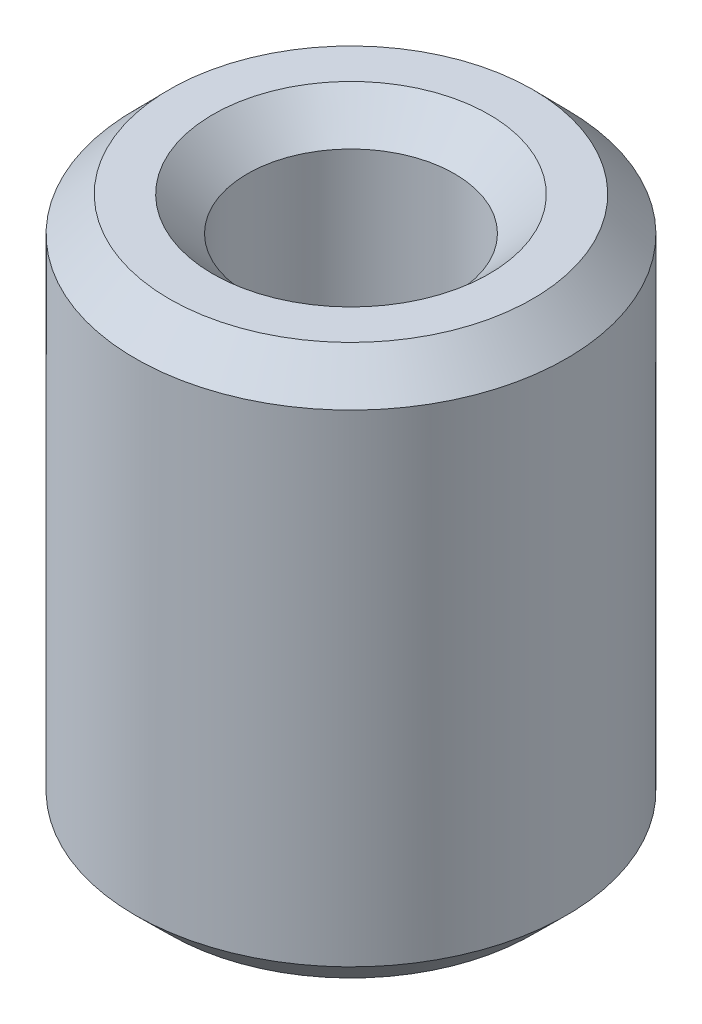
ISO-10303-21;
HEADER;
FILE_DESCRIPTION(('STEP AP214'),'2;1');
FILE_NAME('part.step','',(''),(''),'','','');
FILE_SCHEMA(('AUTOMOTIVE_DESIGN { 1 0 10303 214 1 1 1 1 }'));
ENDSEC;
DATA;
#1=APPLICATION_CONTEXT('core data for automotive mechanical design processes');
#2=APPLICATION_PROTOCOL_DEFINITION('international standard','automotive_design',2000,#1);
#3=PRODUCT_CONTEXT('',#1,'mechanical');
#4=PRODUCT('Part','Part','',(#3));
#5=PRODUCT_RELATED_PRODUCT_CATEGORY('part','',(#4));
#6=PRODUCT_DEFINITION_FORMATION('','',#4);
#7=PRODUCT_DEFINITION_CONTEXT('part definition',#1,'design');
#8=PRODUCT_DEFINITION('design','',#6,#7);
#9=PRODUCT_DEFINITION_SHAPE('','',#8);
#10=(LENGTH_UNIT() NAMED_UNIT(*) SI_UNIT(.MILLI.,.METRE.));
#11=(NAMED_UNIT(*) PLANE_ANGLE_UNIT() SI_UNIT($,.RADIAN.));
#12=(NAMED_UNIT(*) SI_UNIT($,.STERADIAN.) SOLID_ANGLE_UNIT());
#13=UNCERTAINTY_MEASURE_WITH_UNIT(LENGTH_MEASURE(1.E-05),#10,'distance_accuracy_value','');
#14=(GEOMETRIC_REPRESENTATION_CONTEXT(3) GLOBAL_UNCERTAINTY_ASSIGNED_CONTEXT((#13)) GLOBAL_UNIT_ASSIGNED_CONTEXT((#10,
#11,#12)) REPRESENTATION_CONTEXT('',''));
#15=CARTESIAN_POINT('',(0.,0.,0.));
#16=DIRECTION('',(0.,0.,1.));
#17=DIRECTION('',(1.,0.,0.));
#18=AXIS2_PLACEMENT_3D('',#15,#16,#17);
#19=CARTESIAN_POINT('',(0.,19.1574992994997,0.));
#20=DIRECTION('',(0.,-1.,0.));
#21=DIRECTION('',(0.,0.,-1.));
#22=AXIS2_PLACEMENT_3D('',#19,#20,#21);
#23=CYLINDRICAL_SURFACE('',#22,7.5);
#24=CARTESIAN_POINT('',(0.,1.18473737385999,0.));
#25=DIRECTION('',(0.,1.,0.));
#26=DIRECTION('',(0.,0.,1.));
#27=AXIS2_PLACEMENT_3D('',#24,#25,#26);
#28=CIRCLE('',#27,7.5);
#29=CARTESIAN_POINT('',(0.,1.18473737385999,7.5));
#30=VERTEX_POINT('',#29);
#31=EDGE_CURVE('E10',#30,#30,#28,.T.);
#32=ORIENTED_EDGE('',*,*,#31,.T.);
#33=EDGE_LOOP('',(#32));
#34=FACE_BOUND('',#33,.T.);
#35=CARTESIAN_POINT('',(0.,17.9564030926638,0.));
#36=DIRECTION('',(0.,1.,0.));
#37=DIRECTION('',(0.,0.,1.));
#38=AXIS2_PLACEMENT_3D('',#35,#36,#37);
#39=CIRCLE('',#38,7.5);
#40=CARTESIAN_POINT('',(0.,17.9564030926638,-7.5));
#41=VERTEX_POINT('',#40);
#42=EDGE_CURVE('E50',#41,#41,#39,.F.);
#43=ORIENTED_EDGE('',*,*,#42,.T.);
#44=EDGE_LOOP('',(#43));
#45=FACE_BOUND('',#44,.T.);
#46=ADVANCED_FACE('F39',(#34,#45),#23,.T.);
#47=CARTESIAN_POINT('',(0.,19.1574992994997,0.));
#48=DIRECTION('',(0.,1.,0.));
#49=DIRECTION('',(0.,0.,1.));
#50=AXIS2_PLACEMENT_3D('',#47,#48,#49);
#51=PLANE('',#50);
#52=CARTESIAN_POINT('',(0.,19.1574992994997,0.));
#53=DIRECTION('',(0.,1.,0.));
#54=DIRECTION('',(0.,0.,1.));
#55=AXIS2_PLACEMENT_3D('',#52,#53,#54);
#56=CIRCLE('',#55,4.80481325600281);
#57=CARTESIAN_POINT('',(0.,19.1574992994997,4.80481325600281));
#58=VERTEX_POINT('',#57);
#59=EDGE_CURVE('E58',#58,#58,#56,.F.);
#60=ORIENTED_EDGE('',*,*,#59,.T.);
#61=EDGE_LOOP('',(#60));
#62=FACE_BOUND('',#61,.T.);
#63=CARTESIAN_POINT('',(0.,19.1574992994997,0.));
#64=DIRECTION('',(0.,1.,0.));
#65=DIRECTION('',(0.,0.,1.));
#66=AXIS2_PLACEMENT_3D('',#63,#64,#65);
#67=CIRCLE('',#66,6.31526262614001);
#68=CARTESIAN_POINT('',(0.,19.1574992994997,-6.31526262614001));
#69=VERTEX_POINT('',#68);
#70=EDGE_CURVE('E61',#69,#69,#67,.T.);
#71=ORIENTED_EDGE('',*,*,#70,.T.);
#72=EDGE_LOOP('',(#71));
#73=FACE_BOUND('',#72,.T.);
#74=ADVANCED_FACE('F88',(#62,#73),#51,.T.);
#75=CARTESIAN_POINT('',(0.,0.,0.));
#76=DIRECTION('',(0.,1.,0.));
#77=DIRECTION('',(0.,0.,1.));
#78=AXIS2_PLACEMENT_3D('',#75,#76,#77);
#79=PLANE('',#78);
#80=CARTESIAN_POINT('',(0.,0.,0.));
#81=DIRECTION('',(0.,1.,0.));
#82=DIRECTION('',(0.,0.,1.));
#83=AXIS2_PLACEMENT_3D('',#80,#81,#82);
#84=CIRCLE('',#83,4.78845442302691);
#85=CARTESIAN_POINT('',(0.,0.,4.78845442302691));
#86=VERTEX_POINT('',#85);
#87=EDGE_CURVE('E51',#86,#86,#84,.T.);
#88=ORIENTED_EDGE('',*,*,#87,.T.);
#89=EDGE_LOOP('',(#88));
#90=FACE_BOUND('',#89,.T.);
#91=CARTESIAN_POINT('',(0.,0.,0.));
#92=DIRECTION('',(0.,1.,0.));
#93=DIRECTION('',(0.,0.,1.));
#94=AXIS2_PLACEMENT_3D('',#91,#92,#93);
#95=CIRCLE('',#94,6.29890379316409);
#96=CARTESIAN_POINT('',(0.,0.,6.29890379316409));
#97=VERTEX_POINT('',#96);
#98=EDGE_CURVE('E54',#97,#97,#95,.F.);
#99=ORIENTED_EDGE('',*,*,#98,.T.);
#100=EDGE_LOOP('',(#99));
#101=FACE_BOUND('',#100,.T.);
#102=ADVANCED_FACE('F83',(#90,#101),#79,.F.);
#103=CARTESIAN_POINT('',(0.,19.1574992994997,0.));
#104=DIRECTION('',(0.,-1.,0.));
#105=DIRECTION('',(0.,0.,-1.));
#106=AXIS2_PLACEMENT_3D('',#103,#104,#105);
#107=CYLINDRICAL_SURFACE('',#106,3.60371704916692);
#108=CARTESIAN_POINT('',(0.,17.9727619256397,0.));
#109=DIRECTION('',(0.,1.,0.));
#110=DIRECTION('',(0.,0.,1.));
#111=AXIS2_PLACEMENT_3D('',#108,#109,#110);
#112=CIRCLE('',#111,3.60371704916692);
#113=CARTESIAN_POINT('',(0.,17.9727619256397,3.60371704916692));
#114=VERTEX_POINT('',#113);
#115=EDGE_CURVE('E67',#114,#114,#112,.T.);
#116=ORIENTED_EDGE('',*,*,#115,.T.);
#117=EDGE_LOOP('',(#116));
#118=FACE_BOUND('',#117,.T.);
#119=CARTESIAN_POINT('',(0.,1.20109620683591,0.));
#120=DIRECTION('',(0.,1.,0.));
#121=DIRECTION('',(0.,0.,1.));
#122=AXIS2_PLACEMENT_3D('',#119,#120,#121);
#123=CIRCLE('',#122,3.60371704916692);
#124=CARTESIAN_POINT('',(0.,1.20109620683591,3.60371704916692));
#125=VERTEX_POINT('',#124);
#126=EDGE_CURVE('E69',#125,#125,#123,.F.);
#127=ORIENTED_EDGE('',*,*,#126,.T.);
#128=EDGE_LOOP('',(#127));
#129=FACE_BOUND('',#128,.T.);
#130=ADVANCED_FACE('F71',(#118,#129),#107,.F.);
#131=CARTESIAN_POINT('',(0.,17.9727619256397,0.));
#132=DIRECTION('',(0.,1.,0.));
#133=DIRECTION('',(0.,0.,1.));
#134=AXIS2_PLACEMENT_3D('',#131,#132,#133);
#135=CONICAL_SURFACE('',#134,3.60371704916692,0.792254708947175);
#136=ORIENTED_EDGE('',*,*,#59,.F.);
#137=EDGE_LOOP('',(#136));
#138=FACE_BOUND('',#137,.T.);
#139=ORIENTED_EDGE('',*,*,#115,.F.);
#140=EDGE_LOOP('',(#139));
#141=FACE_BOUND('',#140,.T.);
#142=ADVANCED_FACE('F77',(#138,#141),#135,.F.);
#143=CARTESIAN_POINT('',(0.,0.,0.));
#144=DIRECTION('',(0.,-1.,0.));
#145=DIRECTION('',(0.,0.,-1.));
#146=AXIS2_PLACEMENT_3D('',#143,#144,#145);
#147=CONICAL_SURFACE('',#146,4.78845442302691,0.77854161784772);
#148=ORIENTED_EDGE('',*,*,#126,.F.);
#149=EDGE_LOOP('',(#148));
#150=FACE_BOUND('',#149,.T.);
#151=ORIENTED_EDGE('',*,*,#87,.F.);
#152=EDGE_LOOP('',(#151));
#153=FACE_BOUND('',#152,.T.);
#154=ADVANCED_FACE('F73',(#150,#153),#147,.F.);
#155=CARTESIAN_POINT('',(0.,1.18473737385999,0.));
#156=DIRECTION('',(0.,1.,0.));
#157=DIRECTION('',(0.,0.,1.));
#158=AXIS2_PLACEMENT_3D('',#155,#156,#157);
#159=CONICAL_SURFACE('',#158,7.5,0.792254708947176);
#160=ORIENTED_EDGE('',*,*,#98,.F.);
#161=EDGE_LOOP('',(#160));
#162=FACE_BOUND('',#161,.T.);
#163=ORIENTED_EDGE('',*,*,#31,.F.);
#164=EDGE_LOOP('',(#163));
#165=FACE_BOUND('',#164,.T.);
#166=ADVANCED_FACE('F76',(#162,#165),#159,.T.);
#167=CARTESIAN_POINT('',(0.,19.1574992994997,0.));
#168=DIRECTION('',(0.,-1.,0.));
#169=DIRECTION('',(0.,0.,-1.));
#170=AXIS2_PLACEMENT_3D('',#167,#168,#169);
#171=CONICAL_SURFACE('',#170,6.31526262614001,0.778541617847721);
#172=CARTESIAN_POINT('',(0.,17.9564030926638,-7.5));
#173=CARTESIAN_POINT('',(0.,17.968914511485,-7.48765898568896));
#174=CARTESIAN_POINT('',(0.,17.9814259303062,-7.47531797137792));
#175=CARTESIAN_POINT('',(0.,18.0064487679486,-7.45063594275584));
#176=CARTESIAN_POINT('',(0.,18.0189601867698,-7.43829492844479));
#177=CARTESIAN_POINT('',(0.,18.0439830244122,-7.41361289982271));
#178=CARTESIAN_POINT('',(0.,18.0564944432334,-7.40127188551167));
#179=CARTESIAN_POINT('',(0.,18.0815172808759,-7.37658985688959));
#180=CARTESIAN_POINT('',(0.,18.0940286996971,-7.36424884257854));
#181=CARTESIAN_POINT('',(0.,18.1190515373395,-7.33956681395646));
#182=CARTESIAN_POINT('',(0.,18.1315629561607,-7.32722579964542));
#183=CARTESIAN_POINT('',(0.,18.1565857938031,-7.30254377102334));
#184=CARTESIAN_POINT('',(0.,18.1690972126243,-7.29020275671229));
#185=CARTESIAN_POINT('',(0.,18.1941200502667,-7.26552072809021));
#186=CARTESIAN_POINT('',(0.,18.2066314690879,-7.25317971377917));
#187=CARTESIAN_POINT('',(0.,18.2316543067303,-7.22849768515709));
#188=CARTESIAN_POINT('',(0.,18.2441657255516,-7.21615667084605));
#189=CARTESIAN_POINT('',(0.,18.269188563194,-7.19147464222396));
#190=CARTESIAN_POINT('',(0.,18.2816999820152,-7.17913362791292));
#191=CARTESIAN_POINT('',(0.,18.3067228196576,-7.15445159929084));
#192=CARTESIAN_POINT('',(0.,18.3192342384788,-7.1421105849798));
#193=CARTESIAN_POINT('',(0.,18.3442570761212,-7.11742855635771));
#194=CARTESIAN_POINT('',(0.,18.3567684949424,-7.10508754204667));
#195=CARTESIAN_POINT('',(0.,18.3817913325848,-7.08040551342459));
#196=CARTESIAN_POINT('',(0.,18.394302751406,-7.06806449911355));
#197=CARTESIAN_POINT('',(0.,18.4193255890485,-7.04338247049146));
#198=CARTESIAN_POINT('',(0.,18.4318370078697,-7.03104145618042));
#199=CARTESIAN_POINT('',(0.,18.4568598455121,-7.00635942755834));
#200=CARTESIAN_POINT('',(0.,18.4693712643333,-6.9940184132473));
#201=CARTESIAN_POINT('',(0.,18.4943941019757,-6.96933638462521));
#202=CARTESIAN_POINT('',(0.,18.5069055207969,-6.95699537031417));
#203=CARTESIAN_POINT('',(0.,18.5319283584393,-6.93231334169209));
#204=CARTESIAN_POINT('',(0.,18.5444397772605,-6.91997232738105));
#205=CARTESIAN_POINT('',(0.,18.5694626149029,-6.89529029875897));
#206=CARTESIAN_POINT('',(0.,18.5819740337242,-6.88294928444792));
#207=CARTESIAN_POINT('',(0.,18.6069968713666,-6.85826725582584));
#208=CARTESIAN_POINT('',(0.,18.6195082901878,-6.8459262415148));
#209=CARTESIAN_POINT('',(0.,18.6445311278302,-6.82124421289272));
#210=CARTESIAN_POINT('',(0.,18.6570425466514,-6.80890319858167));
#211=CARTESIAN_POINT('',(0.,18.6820653842938,-6.78422116995959));
#212=CARTESIAN_POINT('',(0.,18.694576803115,-6.77188015564855));
#213=CARTESIAN_POINT('',(0.,18.7195996407574,-6.74719812702647));
#214=CARTESIAN_POINT('',(0.,18.7321110595786,-6.73485711271542));
#215=CARTESIAN_POINT('',(0.,18.7571338972211,-6.71017508409334));
#216=CARTESIAN_POINT('',(0.,18.7696453160423,-6.6978340697823));
#217=CARTESIAN_POINT('',(0.,18.7946681536847,-6.67315204116022));
#218=CARTESIAN_POINT('',(0.,18.8071795725059,-6.66081102684918));
#219=CARTESIAN_POINT('',(0.,18.8322024101483,-6.63612899822709));
#220=CARTESIAN_POINT('',(0.,18.8447138289695,-6.62378798391605));
#221=CARTESIAN_POINT('',(0.,18.8697366666119,-6.59910595529397));
#222=CARTESIAN_POINT('',(0.,18.8822480854331,-6.58676494098293));
#223=CARTESIAN_POINT('',(0.,18.9072709230755,-6.56208291236084));
#224=CARTESIAN_POINT('',(0.,18.9197823418967,-6.5497418980498));
#225=CARTESIAN_POINT('',(0.,18.9448051795392,-6.52505986942772));
#226=CARTESIAN_POINT('',(0.,18.9573165983604,-6.51271885511668));
#227=CARTESIAN_POINT('',(0.,18.9823394360028,-6.48803682649459));
#228=CARTESIAN_POINT('',(0.,18.994850854824,-6.47569581218355));
#229=CARTESIAN_POINT('',(0.,19.0198736924664,-6.45101378356147));
#230=CARTESIAN_POINT('',(0.,19.0323851112876,-6.43867276925043));
#231=CARTESIAN_POINT('',(0.,19.05740794893,-6.41399074062834));
#232=CARTESIAN_POINT('',(0.,19.0699193677512,-6.4016497263173));
#233=CARTESIAN_POINT('',(0.,19.0949422053937,-6.37696769769522));
#234=CARTESIAN_POINT('',(0.,19.1074536242149,-6.36462668338418));
#235=CARTESIAN_POINT('',(0.,19.1324764618573,-6.3399446547621));
#236=CARTESIAN_POINT('',(0.,19.1449878806785,-6.32760364045105));
#237=CARTESIAN_POINT('',(0.,19.1574992994997,-6.31526262614001));
#238=B_SPLINE_CURVE_WITH_KNOTS('',3,(#172,#173,#174,#175,#176,#177,#178,#179,#180,#181,#182,
#183,#184,#185,#186,#187,#188,#189,#190,#191,#192,#193,#194,#195,#196,#197,#198,#199,#200,#201,
#202,#203,#204,#205,#206,#207,#208,#209,#210,#211,#212,#213,#214,#215,#216,#217,#218,#219,#220,
#221,#222,#223,#224,#225,#226,#227,#228,#229,#230,#231,#232,#233,#234,#235,#236,#237),
.UNSPECIFIED.,.F.,.F.,(4,2,2,2,2,2,2,2,2,2,2,2,2,2,2,2,2,2,2,2,2,2,2,2,2,2,2,2,2,2,2,2,4),(0.,
0.0527212112560475,0.105442422512097,0.158163633768145,0.210884845024195,0.263606056280245,
0.316327267536292,0.369048478792342,0.42176969004839,0.47449090130444,0.527212112560487,
0.579933323816537,0.632654535072587,0.685375746328635,0.738096957584685,0.790818168840733,
0.843539380096783,0.896260591352833,0.94898180260888,1.00170301386493,1.05442422512098,
1.10714543637703,1.15986664763308,1.21258785888913,1.26530907014517,1.31803028140122,
1.37075149265727,1.42347270391332,1.47619391516937,1.52891512642542,1.58163633768147,
1.63435754893752,1.68707876019357),.UNSPECIFIED.);
#239=EDGE_CURVE('BSEAM45',#41,#69,#238,.T.);
#240=ORIENTED_EDGE('',*,*,#42,.F.);
#241=ORIENTED_EDGE('',*,*,#70,.F.);
#242=ORIENTED_EDGE('',*,*,#239,.T.);
#243=ORIENTED_EDGE('',*,*,#239,.F.);
#244=EDGE_LOOP('',(#240,#242,#241,#243));
#245=FACE_BOUND('',#244,.T.);
#246=ADVANCED_FACE('F45',(#245),#171,.T.);
#247=CLOSED_SHELL('',(#46,#74,#102,#130,#142,#154,#166,#246));
#248=MANIFOLD_SOLID_BREP('B2',#247);
#249=ADVANCED_BREP_SHAPE_REPRESENTATION('',(#18,#248),#14);
#250=SHAPE_DEFINITION_REPRESENTATION(#9,#249);
ENDSEC;
END-ISO-10303-21;
